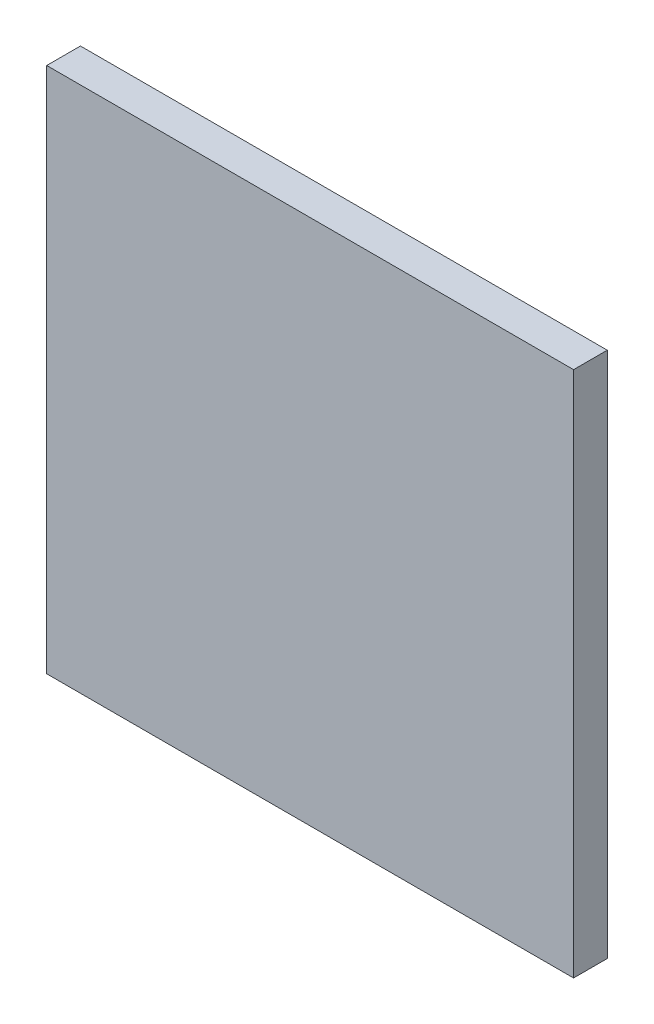
ISO-10303-21;
HEADER;
FILE_DESCRIPTION(('STEP AP214'),'2;1');
FILE_NAME('part.step','',(''),(''),'','','');
FILE_SCHEMA(('AUTOMOTIVE_DESIGN { 1 0 10303 214 1 1 1 1 }'));
ENDSEC;
DATA;
#1=APPLICATION_CONTEXT('core data for automotive mechanical design processes');
#2=APPLICATION_PROTOCOL_DEFINITION('international standard','automotive_design',2000,#1);
#3=PRODUCT_CONTEXT('',#1,'mechanical');
#4=PRODUCT('Part','Part','',(#3));
#5=PRODUCT_RELATED_PRODUCT_CATEGORY('part','',(#4));
#6=PRODUCT_DEFINITION_FORMATION('','',#4);
#7=PRODUCT_DEFINITION_CONTEXT('part definition',#1,'design');
#8=PRODUCT_DEFINITION('design','',#6,#7);
#9=PRODUCT_DEFINITION_SHAPE('','',#8);
#10=(LENGTH_UNIT() NAMED_UNIT(*) SI_UNIT(.MILLI.,.METRE.));
#11=(NAMED_UNIT(*) PLANE_ANGLE_UNIT() SI_UNIT($,.RADIAN.));
#12=(NAMED_UNIT(*) SI_UNIT($,.STERADIAN.) SOLID_ANGLE_UNIT());
#13=UNCERTAINTY_MEASURE_WITH_UNIT(LENGTH_MEASURE(1.E-05),#10,'distance_accuracy_value','');
#14=(GEOMETRIC_REPRESENTATION_CONTEXT(3) GLOBAL_UNCERTAINTY_ASSIGNED_CONTEXT((#13)) GLOBAL_UNIT_ASSIGNED_CONTEXT((#10,
#11,#12)) REPRESENTATION_CONTEXT('',''));
#15=CARTESIAN_POINT('',(0.,0.,0.));
#16=DIRECTION('',(0.,0.,1.));
#17=DIRECTION('',(1.,0.,0.));
#18=AXIS2_PLACEMENT_3D('',#15,#16,#17);
#19=CARTESIAN_POINT('',(-25.,25.,3.2));
#20=DIRECTION('',(0.,-1.,0.));
#21=DIRECTION('',(1.,0.,0.));
#22=AXIS2_PLACEMENT_3D('',#19,#20,#21);
#23=PLANE('',#22);
#24=DIRECTION('',(-1.,0.,0.));
#25=VECTOR('',#24,1.);
#26=CARTESIAN_POINT('',(-25.,25.,0.));
#27=LINE('',#26,#25);
#28=CARTESIAN_POINT('',(25.,25.,0.));
#29=VERTEX_POINT('',#28);
#30=CARTESIAN_POINT('',(-25.,25.,0.));
#31=VERTEX_POINT('',#30);
#32=EDGE_CURVE('E102',#29,#31,#27,.T.);
#33=ORIENTED_EDGE('',*,*,#32,.T.);
#34=DIRECTION('',(0.,0.,-1.));
#35=VECTOR('',#34,1.);
#36=CARTESIAN_POINT('',(-25.,25.,3.2));
#37=LINE('',#36,#35);
#38=CARTESIAN_POINT('',(-25.,25.,3.2));
#39=VERTEX_POINT('',#38);
#40=EDGE_CURVE('E11',#39,#31,#37,.T.);
#41=ORIENTED_EDGE('',*,*,#40,.F.);
#42=DIRECTION('',(-1.,0.,0.));
#43=VECTOR('',#42,1.);
#44=CARTESIAN_POINT('',(-25.,25.,3.2));
#45=LINE('',#44,#43);
#46=CARTESIAN_POINT('',(25.,25.,3.2));
#47=VERTEX_POINT('',#46);
#48=EDGE_CURVE('E90',#47,#39,#45,.T.);
#49=ORIENTED_EDGE('',*,*,#48,.F.);
#50=DIRECTION('',(0.,0.,-1.));
#51=VECTOR('',#50,1.);
#52=CARTESIAN_POINT('',(25.,25.,3.2));
#53=LINE('',#52,#51);
#54=EDGE_CURVE('E98',#47,#29,#53,.T.);
#55=ORIENTED_EDGE('',*,*,#54,.T.);
#56=EDGE_LOOP('',(#33,#41,#49,#55));
#57=FACE_BOUND('',#56,.T.);
#58=ADVANCED_FACE('F39',(#57),#23,.F.);
#59=CARTESIAN_POINT('',(-25.,-25.,3.2));
#60=DIRECTION('',(1.,0.,0.));
#61=DIRECTION('',(0.,0.,-1.));
#62=AXIS2_PLACEMENT_3D('',#59,#60,#61);
#63=PLANE('',#62);
#64=DIRECTION('',(0.,-1.,0.));
#65=VECTOR('',#64,1.);
#66=CARTESIAN_POINT('',(-25.,-25.,0.));
#67=LINE('',#66,#65);
#68=CARTESIAN_POINT('',(-25.,-25.,0.));
#69=VERTEX_POINT('',#68);
#70=EDGE_CURVE('E94',#31,#69,#67,.T.);
#71=ORIENTED_EDGE('',*,*,#70,.T.);
#72=DIRECTION('',(0.,0.,-1.));
#73=VECTOR('',#72,1.);
#74=CARTESIAN_POINT('',(-25.,-25.,3.2));
#75=LINE('',#74,#73);
#76=CARTESIAN_POINT('',(-25.,-25.,3.2));
#77=VERTEX_POINT('',#76);
#78=EDGE_CURVE('E47',#77,#69,#75,.T.);
#79=ORIENTED_EDGE('',*,*,#78,.F.);
#80=DIRECTION('',(0.,-1.,0.));
#81=VECTOR('',#80,1.);
#82=CARTESIAN_POINT('',(-25.,-25.,3.2));
#83=LINE('',#82,#81);
#84=EDGE_CURVE('E85',#39,#77,#83,.T.);
#85=ORIENTED_EDGE('',*,*,#84,.F.);
#86=ORIENTED_EDGE('',*,*,#40,.T.);
#87=EDGE_LOOP('',(#71,#79,#85,#86));
#88=FACE_BOUND('',#87,.T.);
#89=ADVANCED_FACE('F93',(#88),#63,.F.);
#90=CARTESIAN_POINT('',(-25.,-25.,3.2));
#91=DIRECTION('',(0.,1.,0.));
#92=DIRECTION('',(-1.,0.,0.));
#93=AXIS2_PLACEMENT_3D('',#90,#91,#92);
#94=PLANE('',#93);
#95=DIRECTION('',(1.,0.,0.));
#96=VECTOR('',#95,1.);
#97=CARTESIAN_POINT('',(-25.,-25.,0.));
#98=LINE('',#97,#96);
#99=CARTESIAN_POINT('',(25.,-25.,0.));
#100=VERTEX_POINT('',#99);
#101=EDGE_CURVE('E72',#69,#100,#98,.T.);
#102=ORIENTED_EDGE('',*,*,#101,.T.);
#103=DIRECTION('',(0.,0.,-1.));
#104=VECTOR('',#103,1.);
#105=CARTESIAN_POINT('',(25.,-25.,3.2));
#106=LINE('',#105,#104);
#107=CARTESIAN_POINT('',(25.,-25.,3.2));
#108=VERTEX_POINT('',#107);
#109=EDGE_CURVE('E95',#108,#100,#106,.T.);
#110=ORIENTED_EDGE('',*,*,#109,.F.);
#111=DIRECTION('',(1.,0.,0.));
#112=VECTOR('',#111,1.);
#113=CARTESIAN_POINT('',(-25.,-25.,3.2));
#114=LINE('',#113,#112);
#115=EDGE_CURVE('E88',#77,#108,#114,.T.);
#116=ORIENTED_EDGE('',*,*,#115,.F.);
#117=ORIENTED_EDGE('',*,*,#78,.T.);
#118=EDGE_LOOP('',(#102,#110,#116,#117));
#119=FACE_BOUND('',#118,.T.);
#120=ADVANCED_FACE('F96',(#119),#94,.F.);
#121=CARTESIAN_POINT('',(25.,-25.,3.2));
#122=DIRECTION('',(-1.,0.,0.));
#123=DIRECTION('',(0.,0.,1.));
#124=AXIS2_PLACEMENT_3D('',#121,#122,#123);
#125=PLANE('',#124);
#126=DIRECTION('',(0.,1.,0.));
#127=VECTOR('',#126,1.);
#128=CARTESIAN_POINT('',(25.,-25.,0.));
#129=LINE('',#128,#127);
#130=EDGE_CURVE('E78',#100,#29,#129,.T.);
#131=ORIENTED_EDGE('',*,*,#130,.T.);
#132=ORIENTED_EDGE('',*,*,#54,.F.);
#133=DIRECTION('',(0.,1.,0.));
#134=VECTOR('',#133,1.);
#135=CARTESIAN_POINT('',(25.,-25.,3.2));
#136=LINE('',#135,#134);
#137=EDGE_CURVE('E55',#108,#47,#136,.T.);
#138=ORIENTED_EDGE('',*,*,#137,.F.);
#139=ORIENTED_EDGE('',*,*,#109,.T.);
#140=EDGE_LOOP('',(#131,#132,#138,#139));
#141=FACE_BOUND('',#140,.T.);
#142=ADVANCED_FACE('F109',(#141),#125,.F.);
#143=CARTESIAN_POINT('',(0.,0.,3.2));
#144=DIRECTION('',(0.,0.,1.));
#145=DIRECTION('',(1.,0.,0.));
#146=AXIS2_PLACEMENT_3D('',#143,#144,#145);
#147=PLANE('',#146);
#148=ORIENTED_EDGE('',*,*,#48,.T.);
#149=ORIENTED_EDGE('',*,*,#84,.T.);
#150=ORIENTED_EDGE('',*,*,#115,.T.);
#151=ORIENTED_EDGE('',*,*,#137,.T.);
#152=EDGE_LOOP('',(#148,#149,#150,#151));
#153=FACE_BOUND('',#152,.T.);
#154=ADVANCED_FACE('F86',(#153),#147,.T.);
#155=CARTESIAN_POINT('',(0.,0.,0.));
#156=DIRECTION('',(0.,0.,1.));
#157=DIRECTION('',(1.,0.,0.));
#158=AXIS2_PLACEMENT_3D('',#155,#156,#157);
#159=PLANE('',#158);
#160=ORIENTED_EDGE('',*,*,#32,.F.);
#161=ORIENTED_EDGE('',*,*,#130,.F.);
#162=ORIENTED_EDGE('',*,*,#101,.F.);
#163=ORIENTED_EDGE('',*,*,#70,.F.);
#164=EDGE_LOOP('',(#160,#161,#162,#163));
#165=FACE_BOUND('',#164,.T.);
#166=ADVANCED_FACE('F112',(#165),#159,.F.);
#167=CLOSED_SHELL('',(#58,#89,#120,#142,#154,#166));
#168=MANIFOLD_SOLID_BREP('B2',#167);
#169=ADVANCED_BREP_SHAPE_REPRESENTATION('',(#18,#168),#14);
#170=SHAPE_DEFINITION_REPRESENTATION(#9,#169);
ENDSEC;
END-ISO-10303-21;
